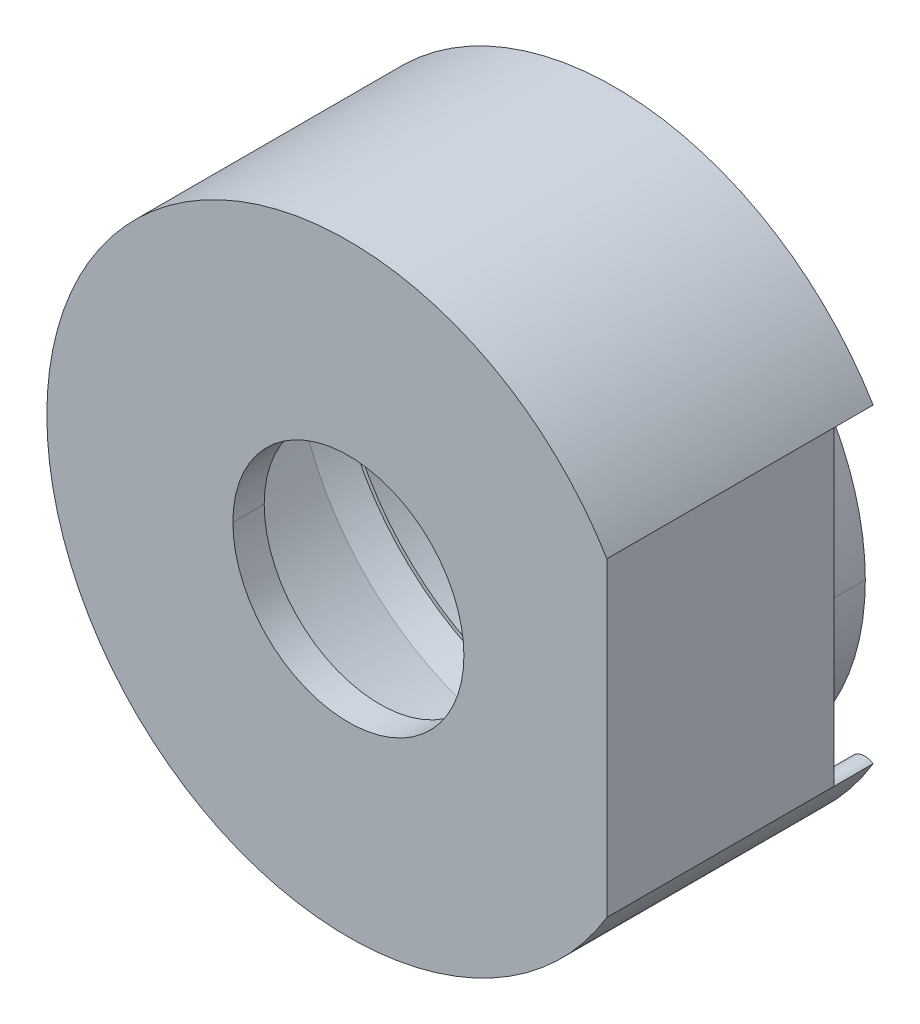
ISO-10303-21;
HEADER;
FILE_DESCRIPTION(('STEP AP214'),'2;1');
FILE_NAME('part.step','',(''),(''),'','','');
FILE_SCHEMA(('AUTOMOTIVE_DESIGN { 1 0 10303 214 1 1 1 1 }'));
ENDSEC;
DATA;
#1=APPLICATION_CONTEXT('core data for automotive mechanical design processes');
#2=APPLICATION_PROTOCOL_DEFINITION('international standard','automotive_design',2000,#1);
#3=PRODUCT_CONTEXT('',#1,'mechanical');
#4=PRODUCT('Part','Part','',(#3));
#5=PRODUCT_RELATED_PRODUCT_CATEGORY('part','',(#4));
#6=PRODUCT_DEFINITION_FORMATION('','',#4);
#7=PRODUCT_DEFINITION_CONTEXT('part definition',#1,'design');
#8=PRODUCT_DEFINITION('design','',#6,#7);
#9=PRODUCT_DEFINITION_SHAPE('','',#8);
#10=(LENGTH_UNIT() NAMED_UNIT(*) SI_UNIT(.MILLI.,.METRE.));
#11=(NAMED_UNIT(*) PLANE_ANGLE_UNIT() SI_UNIT($,.RADIAN.));
#12=(NAMED_UNIT(*) SI_UNIT($,.STERADIAN.) SOLID_ANGLE_UNIT());
#13=UNCERTAINTY_MEASURE_WITH_UNIT(LENGTH_MEASURE(1.E-05),#10,'distance_accuracy_value','');
#14=(GEOMETRIC_REPRESENTATION_CONTEXT(3) GLOBAL_UNCERTAINTY_ASSIGNED_CONTEXT((#13)) GLOBAL_UNIT_ASSIGNED_CONTEXT((#10,
#11,#12)) REPRESENTATION_CONTEXT('',''));
#15=CARTESIAN_POINT('',(0.,0.,0.));
#16=DIRECTION('',(0.,0.,1.));
#17=DIRECTION('',(1.,0.,0.));
#18=AXIS2_PLACEMENT_3D('',#15,#16,#17);
#19=CARTESIAN_POINT('',(15.9628315737893,10.7587410112352,2.5));
#20=DIRECTION('',(0.,0.,-1.));
#21=DIRECTION('',(-1.,0.,0.));
#22=AXIS2_PLACEMENT_3D('',#19,#20,#21);
#23=CYLINDRICAL_SURFACE('',#22,1.);
#24=CARTESIAN_POINT('',(15.9628315737893,10.7587410112352,2.5));
#25=DIRECTION('',(0.,0.,1.));
#26=DIRECTION('',(1.,0.,0.));
#27=AXIS2_PLACEMENT_3D('',#24,#25,#26);
#28=CIRCLE('',#27,1.);
#29=CARTESIAN_POINT('',(15.1335935699561,10.1998453742879,2.5));
#30=VERTEX_POINT('',#29);
#31=CARTESIAN_POINT('',(16.5,9.91526600752596,2.5));
#32=VERTEX_POINT('',#31);
#33=EDGE_CURVE('E215',#30,#32,#28,.T.);
#34=ORIENTED_EDGE('',*,*,#33,.F.);
#35=DIRECTION('',(0.,0.,1.));
#36=VECTOR('',#35,1.);
#37=CARTESIAN_POINT('',(15.1335935699561,10.1998453742879,2.5));
#38=LINE('',#37,#36);
#39=CARTESIAN_POINT('',(15.1335935699561,10.1998453742879,0.));
#40=VERTEX_POINT('',#39);
#41=EDGE_CURVE('E167',#40,#30,#38,.T.);
#42=ORIENTED_EDGE('',*,*,#41,.F.);
#43=CARTESIAN_POINT('',(15.9628315737893,10.7587410112352,0.));
#44=DIRECTION('',(0.,0.,-1.));
#45=DIRECTION('',(1.,0.,0.));
#46=AXIS2_PLACEMENT_3D('',#43,#44,#45);
#47=CIRCLE('',#46,1.);
#48=CARTESIAN_POINT('',(16.5,9.91526600752596,0.));
#49=VERTEX_POINT('',#48);
#50=EDGE_CURVE('E183',#49,#40,#47,.T.);
#51=ORIENTED_EDGE('',*,*,#50,.F.);
#52=DIRECTION('',(0.,0.,-1.));
#53=VECTOR('',#52,1.);
#54=CARTESIAN_POINT('',(16.5,9.91526600752596,2.5));
#55=LINE('',#54,#53);
#56=EDGE_CURVE('E169',#32,#49,#55,.T.);
#57=ORIENTED_EDGE('',*,*,#56,.F.);
#58=EDGE_LOOP('',(#34,#42,#51,#57));
#59=FACE_BOUND('',#58,.T.);
#60=ADVANCED_FACE('F14',(#59),#23,.T.);
#61=CARTESIAN_POINT('',(15.9628315737893,-10.7587410112352,2.5));
#62=DIRECTION('',(0.,0.,1.));
#63=DIRECTION('',(1.,0.,0.));
#64=AXIS2_PLACEMENT_3D('',#61,#62,#63);
#65=CYLINDRICAL_SURFACE('',#64,1.);
#66=CARTESIAN_POINT('',(15.9628315737893,-10.7587410112352,0.));
#67=DIRECTION('',(0.,0.,-1.));
#68=DIRECTION('',(1.,0.,0.));
#69=AXIS2_PLACEMENT_3D('',#66,#67,#68);
#70=CIRCLE('',#69,1.);
#71=CARTESIAN_POINT('',(15.1335935699561,-10.1998453742879,0.));
#72=VERTEX_POINT('',#71);
#73=CARTESIAN_POINT('',(16.5,-9.91526600752597,0.));
#74=VERTEX_POINT('',#73);
#75=EDGE_CURVE('E222',#72,#74,#70,.T.);
#76=ORIENTED_EDGE('',*,*,#75,.F.);
#77=DIRECTION('',(0.,0.,-1.));
#78=VECTOR('',#77,1.);
#79=CARTESIAN_POINT('',(15.1335935699561,-10.1998453742879,2.5));
#80=LINE('',#79,#78);
#81=CARTESIAN_POINT('',(15.1335935699561,-10.1998453742879,2.5));
#82=VERTEX_POINT('',#81);
#83=EDGE_CURVE('E211',#82,#72,#80,.T.);
#84=ORIENTED_EDGE('',*,*,#83,.F.);
#85=CARTESIAN_POINT('',(15.9628315737893,-10.7587410112352,2.5));
#86=DIRECTION('',(0.,0.,1.));
#87=DIRECTION('',(1.,0.,0.));
#88=AXIS2_PLACEMENT_3D('',#85,#86,#87);
#89=CIRCLE('',#88,1.);
#90=CARTESIAN_POINT('',(16.5,-9.91526600752597,2.5));
#91=VERTEX_POINT('',#90);
#92=EDGE_CURVE('E40',#91,#82,#89,.T.);
#93=ORIENTED_EDGE('',*,*,#92,.F.);
#94=DIRECTION('',(0.,0.,1.));
#95=VECTOR('',#94,1.);
#96=CARTESIAN_POINT('',(16.5,-9.91526600752597,2.5));
#97=LINE('',#96,#95);
#98=EDGE_CURVE('E173',#74,#91,#97,.T.);
#99=ORIENTED_EDGE('',*,*,#98,.F.);
#100=EDGE_LOOP('',(#76,#84,#93,#99));
#101=FACE_BOUND('',#100,.T.);
#102=ADVANCED_FACE('F304',(#101),#65,.T.);
#103=CARTESIAN_POINT('',(16.5,16.5737441106063,17.));
#104=DIRECTION('',(-1.,0.,0.));
#105=DIRECTION('',(0.,0.,1.));
#106=AXIS2_PLACEMENT_3D('',#103,#104,#105);
#107=PLANE('',#106);
#108=DIRECTION('',(0.,0.,1.));
#109=VECTOR('',#108,1.);
#110=CARTESIAN_POINT('',(16.5,-9.91526600752597,2.5));
#111=LINE('',#110,#109);
#112=CARTESIAN_POINT('',(16.5,-9.91526600752597,17.));
#113=VERTEX_POINT('',#112);
#114=EDGE_CURVE('E177',#91,#113,#111,.T.);
#115=ORIENTED_EDGE('',*,*,#114,.F.);
#116=DIRECTION('',(0.,-1.,0.));
#117=VECTOR('',#116,1.);
#118=CARTESIAN_POINT('',(16.5,0.,2.5));
#119=LINE('',#118,#117);
#120=EDGE_CURVE('E212',#32,#91,#119,.T.);
#121=ORIENTED_EDGE('',*,*,#120,.F.);
#122=DIRECTION('',(0.,0.,-1.));
#123=VECTOR('',#122,1.);
#124=CARTESIAN_POINT('',(16.5,9.91526600752596,2.5));
#125=LINE('',#124,#123);
#126=CARTESIAN_POINT('',(16.5,9.91526600752596,17.));
#127=VERTEX_POINT('',#126);
#128=EDGE_CURVE('E172',#127,#32,#125,.T.);
#129=ORIENTED_EDGE('',*,*,#128,.F.);
#130=DIRECTION('',(0.,1.,0.));
#131=VECTOR('',#130,1.);
#132=CARTESIAN_POINT('',(16.5,16.5737441106063,17.));
#133=LINE('',#132,#131);
#134=EDGE_CURVE('E251',#113,#127,#133,.T.);
#135=ORIENTED_EDGE('',*,*,#134,.F.);
#136=EDGE_LOOP('',(#115,#121,#129,#135));
#137=FACE_BOUND('',#136,.T.);
#138=ADVANCED_FACE('F310',(#137),#107,.F.);
#139=CARTESIAN_POINT('',(0.,0.,6.5));
#140=DIRECTION('',(0.,0.,1.));
#141=DIRECTION('',(1.,0.,0.));
#142=AXIS2_PLACEMENT_3D('',#139,#140,#141);
#143=CONICAL_SURFACE('',#142,16.4973120113727,0.244346095279213);
#144=DIRECTION('',(-0.241921895599675,0.,0.970295726275995));
#145=VECTOR('',#144,1.);
#146=CARTESIAN_POINT('',(-16.4973120113727,0.,6.5));
#147=LINE('',#146,#145);
#148=CARTESIAN_POINT('',(-15.5,0.,2.5));
#149=VERTEX_POINT('',#148);
#150=CARTESIAN_POINT('',(-16.,0.,4.50539046676785));
#151=VERTEX_POINT('',#150);
#152=EDGE_CURVE('E240',#149,#151,#147,.T.);
#153=ORIENTED_EDGE('',*,*,#152,.F.);
#154=CARTESIAN_POINT('',(0.,0.,2.5));
#155=DIRECTION('',(0.,0.,-1.));
#156=DIRECTION('',(1.,0.,0.));
#157=AXIS2_PLACEMENT_3D('',#154,#155,#156);
#158=CIRCLE('',#157,15.5);
#159=CARTESIAN_POINT('',(15.5,0.,2.5));
#160=VERTEX_POINT('',#159);
#161=EDGE_CURVE('E218',#149,#160,#158,.T.);
#162=ORIENTED_EDGE('',*,*,#161,.T.);
#163=DIRECTION('',(0.241921895599675,0.,0.970295726275995));
#164=VECTOR('',#163,1.);
#165=CARTESIAN_POINT('',(16.4973120113727,0.,6.5));
#166=LINE('',#165,#164);
#167=CARTESIAN_POINT('',(16.,0.,4.50539046676785));
#168=VERTEX_POINT('',#167);
#169=EDGE_CURVE('E184',#160,#168,#166,.T.);
#170=ORIENTED_EDGE('',*,*,#169,.T.);
#171=CARTESIAN_POINT('',(0.,0.,4.50539046676785));
#172=DIRECTION('',(0.,0.,-1.));
#173=DIRECTION('',(1.,0.,0.));
#174=AXIS2_PLACEMENT_3D('',#171,#172,#173);
#175=CIRCLE('',#174,16.);
#176=EDGE_CURVE('E257',#151,#168,#175,.T.);
#177=ORIENTED_EDGE('',*,*,#176,.F.);
#178=EDGE_LOOP('',(#153,#162,#170,#177));
#179=FACE_BOUND('',#178,.T.);
#180=ADVANCED_FACE('F275',(#179),#143,.F.);
#181=CARTESIAN_POINT('',(0.,0.,0.));
#182=DIRECTION('',(0.,0.,-1.));
#183=DIRECTION('',(0.,-1.,0.));
#184=AXIS2_PLACEMENT_3D('',#181,#182,#183);
#185=PLANE('',#184);
#186=CARTESIAN_POINT('',(0.,0.,0.));
#187=DIRECTION('',(0.,0.,-1.));
#188=DIRECTION('',(-1.,0.,0.));
#189=AXIS2_PLACEMENT_3D('',#186,#187,#188);
#190=CIRCLE('',#189,15.25);
#191=CARTESIAN_POINT('',(-15.25,0.,0.));
#192=VERTEX_POINT('',#191);
#193=CARTESIAN_POINT('',(15.25,0.,0.));
#194=VERTEX_POINT('',#193);
#195=EDGE_CURVE('E9',#192,#194,#190,.T.);
#196=ORIENTED_EDGE('',*,*,#195,.F.);
#197=CARTESIAN_POINT('',(0.,0.,0.));
#198=DIRECTION('',(0.,0.,-1.));
#199=DIRECTION('',(-1.,0.,0.));
#200=AXIS2_PLACEMENT_3D('',#197,#198,#199);
#201=CIRCLE('',#200,15.25);
#202=EDGE_CURVE('E189',#194,#192,#201,.T.);
#203=ORIENTED_EDGE('',*,*,#202,.F.);
#204=EDGE_LOOP('',(#196,#203));
#205=FACE_BOUND('',#204,.T.);
#206=CARTESIAN_POINT('',(0.,0.,0.));
#207=DIRECTION('',(0.,0.,-1.));
#208=DIRECTION('',(-1.,0.,0.));
#209=AXIS2_PLACEMENT_3D('',#206,#207,#208);
#210=CIRCLE('',#209,16.);
#211=CARTESIAN_POINT('',(-16.,0.,0.));
#212=VERTEX_POINT('',#211);
#213=CARTESIAN_POINT('',(16.,0.,0.));
#214=VERTEX_POINT('',#213);
#215=EDGE_CURVE('E148',#212,#214,#210,.T.);
#216=ORIENTED_EDGE('',*,*,#215,.T.);
#217=CARTESIAN_POINT('',(0.,0.,0.));
#218=DIRECTION('',(0.,0.,-1.));
#219=DIRECTION('',(-1.,0.,0.));
#220=AXIS2_PLACEMENT_3D('',#217,#218,#219);
#221=CIRCLE('',#220,16.);
#222=EDGE_CURVE('E25',#214,#212,#221,.T.);
#223=ORIENTED_EDGE('',*,*,#222,.T.);
#224=EDGE_LOOP('',(#216,#223));
#225=FACE_BOUND('',#224,.T.);
#226=ADVANCED_FACE('F149',(#205,#225),#185,.T.);
#227=CARTESIAN_POINT('',(0.,0.,47.754833995939));
#228=DIRECTION('',(0.,0.,-1.));
#229=DIRECTION('',(-1.,0.,0.));
#230=AXIS2_PLACEMENT_3D('',#227,#228,#229);
#231=CYLINDRICAL_SURFACE('',#230,15.25);
#232=DIRECTION('',(0.,0.,-1.));
#233=VECTOR('',#232,1.);
#234=CARTESIAN_POINT('',(15.25,0.,47.754833995939));
#235=LINE('',#234,#233);
#236=CARTESIAN_POINT('',(15.25,0.,2.5));
#237=VERTEX_POINT('',#236);
#238=EDGE_CURVE('E193',#237,#194,#235,.T.);
#239=ORIENTED_EDGE('',*,*,#238,.F.);
#240=CARTESIAN_POINT('',(0.,0.,2.5));
#241=DIRECTION('',(0.,0.,-1.));
#242=DIRECTION('',(1.,0.,0.));
#243=AXIS2_PLACEMENT_3D('',#240,#241,#242);
#244=CIRCLE('',#243,15.25);
#245=CARTESIAN_POINT('',(-15.25,0.,2.5));
#246=VERTEX_POINT('',#245);
#247=EDGE_CURVE('E146',#246,#237,#244,.T.);
#248=ORIENTED_EDGE('',*,*,#247,.F.);
#249=DIRECTION('',(0.,0.,-1.));
#250=VECTOR('',#249,1.);
#251=CARTESIAN_POINT('',(-15.25,0.,47.754833995939));
#252=LINE('',#251,#250);
#253=EDGE_CURVE('E163',#246,#192,#252,.T.);
#254=ORIENTED_EDGE('',*,*,#253,.T.);
#255=ORIENTED_EDGE('',*,*,#195,.T.);
#256=EDGE_LOOP('',(#239,#248,#254,#255));
#257=FACE_BOUND('',#256,.T.);
#258=ADVANCED_FACE('F299',(#257),#231,.F.);
#259=CARTESIAN_POINT('',(0.,0.,47.754833995939));
#260=DIRECTION('',(0.,0.,-1.));
#261=DIRECTION('',(-1.,0.,0.));
#262=AXIS2_PLACEMENT_3D('',#259,#260,#261);
#263=CYLINDRICAL_SURFACE('',#262,16.);
#264=DIRECTION('',(0.,0.,-1.));
#265=VECTOR('',#264,1.);
#266=CARTESIAN_POINT('',(16.,0.,47.754833995939));
#267=LINE('',#266,#265);
#268=CARTESIAN_POINT('',(16.,0.,2.5));
#269=VERTEX_POINT('',#268);
#270=EDGE_CURVE('E139',#269,#214,#267,.T.);
#271=ORIENTED_EDGE('',*,*,#270,.F.);
#272=CARTESIAN_POINT('',(0.,0.,2.5));
#273=DIRECTION('',(0.,0.,-1.));
#274=DIRECTION('',(1.,0.,0.));
#275=AXIS2_PLACEMENT_3D('',#272,#273,#274);
#276=CIRCLE('',#275,16.);
#277=CARTESIAN_POINT('',(-16.,0.,2.5));
#278=VERTEX_POINT('',#277);
#279=EDGE_CURVE('E232',#269,#278,#276,.T.);
#280=ORIENTED_EDGE('',*,*,#279,.T.);
#281=DIRECTION('',(0.,0.,-1.));
#282=VECTOR('',#281,1.);
#283=CARTESIAN_POINT('',(-16.,0.,47.754833995939));
#284=LINE('',#283,#282);
#285=EDGE_CURVE('E142',#278,#212,#284,.T.);
#286=ORIENTED_EDGE('',*,*,#285,.T.);
#287=ORIENTED_EDGE('',*,*,#222,.F.);
#288=EDGE_LOOP('',(#271,#280,#286,#287));
#289=FACE_BOUND('',#288,.T.);
#290=ADVANCED_FACE('F137',(#289),#263,.T.);
#291=CARTESIAN_POINT('',(0.,0.,2.5));
#292=DIRECTION('',(0.,0.,1.));
#293=DIRECTION('',(1.,0.,0.));
#294=AXIS2_PLACEMENT_3D('',#291,#292,#293);
#295=PLANE('',#294);
#296=ORIENTED_EDGE('',*,*,#247,.T.);
#297=CARTESIAN_POINT('',(0.,0.,2.5));
#298=DIRECTION('',(0.,0.,-1.));
#299=DIRECTION('',(1.,0.,0.));
#300=AXIS2_PLACEMENT_3D('',#297,#298,#299);
#301=CIRCLE('',#300,15.25);
#302=EDGE_CURVE('E188',#237,#246,#301,.T.);
#303=ORIENTED_EDGE('',*,*,#302,.T.);
#304=EDGE_LOOP('',(#296,#303));
#305=FACE_BOUND('',#304,.T.);
#306=CARTESIAN_POINT('',(0.,0.,2.5));
#307=DIRECTION('',(0.,0.,-1.));
#308=DIRECTION('',(1.,0.,0.));
#309=AXIS2_PLACEMENT_3D('',#306,#307,#308);
#310=CIRCLE('',#309,15.5);
#311=EDGE_CURVE('E244',#160,#149,#310,.T.);
#312=ORIENTED_EDGE('',*,*,#311,.F.);
#313=ORIENTED_EDGE('',*,*,#161,.F.);
#314=EDGE_LOOP('',(#312,#313));
#315=FACE_BOUND('',#314,.T.);
#316=ADVANCED_FACE('F286',(#305,#315),#295,.T.);
#317=CARTESIAN_POINT('',(0.,0.,15.));
#318=DIRECTION('',(0.,0.,1.));
#319=DIRECTION('',(1.,0.,0.));
#320=AXIS2_PLACEMENT_3D('',#317,#318,#319);
#321=CYLINDRICAL_SURFACE('',#320,7.375);
#322=DIRECTION('',(0.,0.,1.));
#323=VECTOR('',#322,1.);
#324=CARTESIAN_POINT('',(-7.375,0.,15.));
#325=LINE('',#324,#323);
#326=CARTESIAN_POINT('',(-7.375,0.,15.));
#327=VERTEX_POINT('',#326);
#328=CARTESIAN_POINT('',(-7.375,0.,17.));
#329=VERTEX_POINT('',#328);
#330=EDGE_CURVE('E199',#327,#329,#325,.T.);
#331=ORIENTED_EDGE('',*,*,#330,.F.);
#332=CARTESIAN_POINT('',(0.,0.,15.));
#333=DIRECTION('',(0.,0.,1.));
#334=DIRECTION('',(1.,0.,0.));
#335=AXIS2_PLACEMENT_3D('',#332,#333,#334);
#336=CIRCLE('',#335,7.375);
#337=CARTESIAN_POINT('',(7.375,0.,15.));
#338=VERTEX_POINT('',#337);
#339=EDGE_CURVE('E234',#338,#327,#336,.T.);
#340=ORIENTED_EDGE('',*,*,#339,.F.);
#341=DIRECTION('',(0.,0.,1.));
#342=VECTOR('',#341,1.);
#343=CARTESIAN_POINT('',(7.375,0.,15.));
#344=LINE('',#343,#342);
#345=CARTESIAN_POINT('',(7.375,0.,17.));
#346=VERTEX_POINT('',#345);
#347=EDGE_CURVE('E198',#338,#346,#344,.T.);
#348=ORIENTED_EDGE('',*,*,#347,.T.);
#349=CARTESIAN_POINT('',(0.,0.,17.));
#350=DIRECTION('',(0.,0.,1.));
#351=DIRECTION('',(1.,0.,0.));
#352=AXIS2_PLACEMENT_3D('',#349,#350,#351);
#353=CIRCLE('',#352,7.375);
#354=EDGE_CURVE('E247',#346,#329,#353,.T.);
#355=ORIENTED_EDGE('',*,*,#354,.T.);
#356=EDGE_LOOP('',(#331,#340,#348,#355));
#357=FACE_BOUND('',#356,.T.);
#358=ADVANCED_FACE('F288',(#357),#321,.F.);
#359=CARTESIAN_POINT('',(0.,0.,15.));
#360=DIRECTION('',(0.,0.,1.));
#361=DIRECTION('',(1.,0.,0.));
#362=AXIS2_PLACEMENT_3D('',#359,#360,#361);
#363=PLANE('',#362);
#364=ORIENTED_EDGE('',*,*,#339,.T.);
#365=CARTESIAN_POINT('',(0.,0.,15.));
#366=DIRECTION('',(0.,0.,1.));
#367=DIRECTION('',(1.,0.,0.));
#368=AXIS2_PLACEMENT_3D('',#365,#366,#367);
#369=CIRCLE('',#368,7.375);
#370=EDGE_CURVE('E202',#327,#338,#369,.T.);
#371=ORIENTED_EDGE('',*,*,#370,.T.);
#372=EDGE_LOOP('',(#364,#371));
#373=FACE_BOUND('',#372,.T.);
#374=CARTESIAN_POINT('',(0.,0.,15.));
#375=DIRECTION('',(0.,0.,1.));
#376=DIRECTION('',(1.,0.,0.));
#377=AXIS2_PLACEMENT_3D('',#374,#375,#376);
#378=CIRCLE('',#377,16.);
#379=CARTESIAN_POINT('',(-16.,0.,15.));
#380=VERTEX_POINT('',#379);
#381=CARTESIAN_POINT('',(16.,0.,15.));
#382=VERTEX_POINT('',#381);
#383=EDGE_CURVE('E228',#380,#382,#378,.T.);
#384=ORIENTED_EDGE('',*,*,#383,.F.);
#385=CARTESIAN_POINT('',(0.,0.,15.));
#386=DIRECTION('',(0.,0.,1.));
#387=DIRECTION('',(1.,0.,0.));
#388=AXIS2_PLACEMENT_3D('',#385,#386,#387);
#389=CIRCLE('',#388,16.);
#390=EDGE_CURVE('E239',#382,#380,#389,.T.);
#391=ORIENTED_EDGE('',*,*,#390,.F.);
#392=EDGE_LOOP('',(#384,#391));
#393=FACE_BOUND('',#392,.T.);
#394=ADVANCED_FACE('F296',(#373,#393),#363,.F.);
#395=CARTESIAN_POINT('',(0.,0.,2.5));
#396=DIRECTION('',(0.,0.,1.));
#397=DIRECTION('',(1.,0.,0.));
#398=AXIS2_PLACEMENT_3D('',#395,#396,#397);
#399=PLANE('',#398);
#400=CARTESIAN_POINT('',(0.,0.,2.5));
#401=DIRECTION('',(0.,0.,-1.));
#402=DIRECTION('',(1.,0.,0.));
#403=AXIS2_PLACEMENT_3D('',#400,#401,#402);
#404=CIRCLE('',#403,16.);
#405=EDGE_CURVE('E155',#278,#269,#404,.T.);
#406=ORIENTED_EDGE('',*,*,#405,.F.);
#407=ORIENTED_EDGE('',*,*,#279,.F.);
#408=EDGE_LOOP('',(#406,#407));
#409=FACE_BOUND('',#408,.T.);
#410=CARTESIAN_POINT('',(0.,0.,2.5));
#411=DIRECTION('',(0.,0.,1.));
#412=DIRECTION('',(1.,0.,0.));
#413=AXIS2_PLACEMENT_3D('',#410,#411,#412);
#414=CIRCLE('',#413,18.25);
#415=CARTESIAN_POINT('',(-18.25,0.,2.5));
#416=VERTEX_POINT('',#415);
#417=EDGE_CURVE('E379',#30,#416,#414,.T.);
#418=ORIENTED_EDGE('',*,*,#417,.F.);
#419=ORIENTED_EDGE('',*,*,#33,.T.);
#420=ORIENTED_EDGE('',*,*,#120,.T.);
#421=ORIENTED_EDGE('',*,*,#92,.T.);
#422=CARTESIAN_POINT('',(0.,0.,2.5));
#423=DIRECTION('',(0.,0.,1.));
#424=DIRECTION('',(1.,0.,0.));
#425=AXIS2_PLACEMENT_3D('',#422,#423,#424);
#426=CIRCLE('',#425,18.25);
#427=EDGE_CURVE('E171',#416,#82,#426,.T.);
#428=ORIENTED_EDGE('',*,*,#427,.F.);
#429=EDGE_LOOP('',(#418,#419,#420,#421,#428));
#430=FACE_BOUND('',#429,.T.);
#431=ADVANCED_FACE('F16',(#409,#430),#399,.F.);
#432=CARTESIAN_POINT('',(0.,0.,17.));
#433=DIRECTION('',(0.,0.,1.));
#434=DIRECTION('',(1.,0.,0.));
#435=AXIS2_PLACEMENT_3D('',#432,#433,#434);
#436=PLANE('',#435);
#437=ORIENTED_EDGE('',*,*,#354,.F.);
#438=CARTESIAN_POINT('',(0.,0.,17.));
#439=DIRECTION('',(0.,0.,1.));
#440=DIRECTION('',(1.,0.,0.));
#441=AXIS2_PLACEMENT_3D('',#438,#439,#440);
#442=CIRCLE('',#441,7.375);
#443=EDGE_CURVE('E194',#329,#346,#442,.T.);
#444=ORIENTED_EDGE('',*,*,#443,.F.);
#445=EDGE_LOOP('',(#437,#444));
#446=FACE_BOUND('',#445,.T.);
#447=ORIENTED_EDGE('',*,*,#134,.T.);
#448=CARTESIAN_POINT('',(0.,0.,17.));
#449=DIRECTION('',(0.,0.,1.));
#450=DIRECTION('',(1.,0.,0.));
#451=AXIS2_PLACEMENT_3D('',#448,#449,#450);
#452=CIRCLE('',#451,19.25);
#453=CARTESIAN_POINT('',(-19.25,0.,17.));
#454=VERTEX_POINT('',#453);
#455=EDGE_CURVE('E179',#127,#454,#452,.T.);
#456=ORIENTED_EDGE('',*,*,#455,.T.);
#457=CARTESIAN_POINT('',(0.,0.,17.));
#458=DIRECTION('',(0.,0.,1.));
#459=DIRECTION('',(1.,0.,0.));
#460=AXIS2_PLACEMENT_3D('',#457,#458,#459);
#461=CIRCLE('',#460,19.25);
#462=EDGE_CURVE('E372',#454,#113,#461,.T.);
#463=ORIENTED_EDGE('',*,*,#462,.T.);
#464=EDGE_LOOP('',(#447,#456,#463));
#465=FACE_BOUND('',#464,.T.);
#466=ADVANCED_FACE('F346',(#446,#465),#436,.T.);
#467=CARTESIAN_POINT('',(0.,0.,2.5));
#468=DIRECTION('',(0.,0.,-1.));
#469=DIRECTION('',(-1.,0.,0.));
#470=AXIS2_PLACEMENT_3D('',#467,#468,#469);
#471=CYLINDRICAL_SURFACE('',#470,18.25);
#472=DIRECTION('',(0.,0.,-1.));
#473=VECTOR('',#472,1.);
#474=CARTESIAN_POINT('',(-18.25,0.,2.5));
#475=LINE('',#474,#473);
#476=CARTESIAN_POINT('',(-18.25,0.,0.));
#477=VERTEX_POINT('',#476);
#478=EDGE_CURVE('E207',#416,#477,#475,.T.);
#479=ORIENTED_EDGE('',*,*,#478,.F.);
#480=ORIENTED_EDGE('',*,*,#427,.T.);
#481=ORIENTED_EDGE('',*,*,#83,.T.);
#482=CARTESIAN_POINT('',(0.,0.,0.));
#483=DIRECTION('',(0.,0.,1.));
#484=DIRECTION('',(1.,0.,0.));
#485=AXIS2_PLACEMENT_3D('',#482,#483,#484);
#486=CIRCLE('',#485,18.25);
#487=EDGE_CURVE('E230',#477,#72,#486,.T.);
#488=ORIENTED_EDGE('',*,*,#487,.F.);
#489=EDGE_LOOP('',(#479,#480,#481,#488));
#490=FACE_BOUND('',#489,.T.);
#491=ADVANCED_FACE('F334',(#490),#471,.F.);
#492=CARTESIAN_POINT('',(0.,0.,2.5));
#493=DIRECTION('',(0.,0.,-1.));
#494=DIRECTION('',(-1.,0.,0.));
#495=AXIS2_PLACEMENT_3D('',#492,#493,#494);
#496=CYLINDRICAL_SURFACE('',#495,19.25);
#497=DIRECTION('',(0.,0.,-1.));
#498=VECTOR('',#497,1.);
#499=CARTESIAN_POINT('',(-19.25,0.,2.5));
#500=LINE('',#499,#498);
#501=CARTESIAN_POINT('',(-19.25,0.,0.));
#502=VERTEX_POINT('',#501);
#503=EDGE_CURVE('E389',#454,#502,#500,.T.);
#504=ORIENTED_EDGE('',*,*,#503,.F.);
#505=ORIENTED_EDGE('',*,*,#455,.F.);
#506=ORIENTED_EDGE('',*,*,#128,.T.);
#507=ORIENTED_EDGE('',*,*,#56,.T.);
#508=CARTESIAN_POINT('',(0.,0.,0.));
#509=DIRECTION('',(0.,0.,1.));
#510=DIRECTION('',(1.,0.,0.));
#511=AXIS2_PLACEMENT_3D('',#508,#509,#510);
#512=CIRCLE('',#511,19.25);
#513=EDGE_CURVE('E219',#49,#502,#512,.T.);
#514=ORIENTED_EDGE('',*,*,#513,.T.);
#515=EDGE_LOOP('',(#504,#505,#506,#507,#514));
#516=FACE_BOUND('',#515,.T.);
#517=ADVANCED_FACE('F330',(#516),#496,.T.);
#518=CARTESIAN_POINT('',(0.,0.,0.));
#519=DIRECTION('',(0.,0.,1.));
#520=DIRECTION('',(1.,0.,0.));
#521=AXIS2_PLACEMENT_3D('',#518,#519,#520);
#522=PLANE('',#521);
#523=CARTESIAN_POINT('',(0.,0.,0.));
#524=DIRECTION('',(0.,0.,1.));
#525=DIRECTION('',(1.,0.,0.));
#526=AXIS2_PLACEMENT_3D('',#523,#524,#525);
#527=CIRCLE('',#526,18.25);
#528=EDGE_CURVE('E203',#40,#477,#527,.T.);
#529=ORIENTED_EDGE('',*,*,#528,.T.);
#530=ORIENTED_EDGE('',*,*,#487,.T.);
#531=ORIENTED_EDGE('',*,*,#75,.T.);
#532=CARTESIAN_POINT('',(0.,0.,0.));
#533=DIRECTION('',(0.,0.,1.));
#534=DIRECTION('',(1.,0.,0.));
#535=AXIS2_PLACEMENT_3D('',#532,#533,#534);
#536=CIRCLE('',#535,19.25);
#537=EDGE_CURVE('E178',#502,#74,#536,.T.);
#538=ORIENTED_EDGE('',*,*,#537,.F.);
#539=ORIENTED_EDGE('',*,*,#513,.F.);
#540=ORIENTED_EDGE('',*,*,#50,.T.);
#541=EDGE_LOOP('',(#529,#530,#531,#538,#539,#540));
#542=FACE_BOUND('',#541,.T.);
#543=ADVANCED_FACE('F333',(#542),#522,.F.);
#544=CARTESIAN_POINT('',(0.,0.,17.));
#545=DIRECTION('',(0.,0.,-1.));
#546=DIRECTION('',(-1.,0.,0.));
#547=AXIS2_PLACEMENT_3D('',#544,#545,#546);
#548=CYLINDRICAL_SURFACE('',#547,16.);
#549=DIRECTION('',(0.,0.,-1.));
#550=VECTOR('',#549,1.);
#551=CARTESIAN_POINT('',(16.,0.,17.));
#552=LINE('',#551,#550);
#553=EDGE_CURVE('E223',#382,#168,#552,.T.);
#554=ORIENTED_EDGE('',*,*,#553,.F.);
#555=ORIENTED_EDGE('',*,*,#390,.T.);
#556=DIRECTION('',(0.,0.,-1.));
#557=VECTOR('',#556,1.);
#558=CARTESIAN_POINT('',(-16.,0.,17.));
#559=LINE('',#558,#557);
#560=EDGE_CURVE('E227',#380,#151,#559,.T.);
#561=ORIENTED_EDGE('',*,*,#560,.T.);
#562=ORIENTED_EDGE('',*,*,#176,.T.);
#563=EDGE_LOOP('',(#554,#555,#561,#562));
#564=FACE_BOUND('',#563,.T.);
#565=ADVANCED_FACE('F328',(#564),#548,.F.);
#566=CARTESIAN_POINT('',(0.,0.,17.));
#567=DIRECTION('',(0.,0.,-1.));
#568=DIRECTION('',(-1.,0.,0.));
#569=AXIS2_PLACEMENT_3D('',#566,#567,#568);
#570=CYLINDRICAL_SURFACE('',#569,16.);
#571=ORIENTED_EDGE('',*,*,#383,.T.);
#572=ORIENTED_EDGE('',*,*,#553,.T.);
#573=CARTESIAN_POINT('',(0.,0.,4.50539046676785));
#574=DIRECTION('',(0.,0.,-1.));
#575=DIRECTION('',(1.,0.,0.));
#576=AXIS2_PLACEMENT_3D('',#573,#574,#575);
#577=CIRCLE('',#576,16.);
#578=EDGE_CURVE('E18',#168,#151,#577,.T.);
#579=ORIENTED_EDGE('',*,*,#578,.T.);
#580=ORIENTED_EDGE('',*,*,#560,.F.);
#581=EDGE_LOOP('',(#571,#572,#579,#580));
#582=FACE_BOUND('',#581,.T.);
#583=ADVANCED_FACE('F325',(#582),#570,.F.);
#584=CARTESIAN_POINT('',(0.,0.,2.5));
#585=DIRECTION('',(0.,0.,-1.));
#586=DIRECTION('',(-1.,0.,0.));
#587=AXIS2_PLACEMENT_3D('',#584,#585,#586);
#588=CYLINDRICAL_SURFACE('',#587,19.25);
#589=ORIENTED_EDGE('',*,*,#462,.F.);
#590=ORIENTED_EDGE('',*,*,#503,.T.);
#591=ORIENTED_EDGE('',*,*,#537,.T.);
#592=ORIENTED_EDGE('',*,*,#98,.T.);
#593=ORIENTED_EDGE('',*,*,#114,.T.);
#594=EDGE_LOOP('',(#589,#590,#591,#592,#593));
#595=FACE_BOUND('',#594,.T.);
#596=ADVANCED_FACE('F323',(#595),#588,.T.);
#597=CARTESIAN_POINT('',(0.,0.,2.5));
#598=DIRECTION('',(0.,0.,-1.));
#599=DIRECTION('',(-1.,0.,0.));
#600=AXIS2_PLACEMENT_3D('',#597,#598,#599);
#601=CYLINDRICAL_SURFACE('',#600,18.25);
#602=ORIENTED_EDGE('',*,*,#417,.T.);
#603=ORIENTED_EDGE('',*,*,#478,.T.);
#604=ORIENTED_EDGE('',*,*,#528,.F.);
#605=ORIENTED_EDGE('',*,*,#41,.T.);
#606=EDGE_LOOP('',(#602,#603,#604,#605));
#607=FACE_BOUND('',#606,.T.);
#608=ADVANCED_FACE('F319',(#607),#601,.F.);
#609=CARTESIAN_POINT('',(0.,0.,15.));
#610=DIRECTION('',(0.,0.,1.));
#611=DIRECTION('',(1.,0.,0.));
#612=AXIS2_PLACEMENT_3D('',#609,#610,#611);
#613=CYLINDRICAL_SURFACE('',#612,7.375);
#614=ORIENTED_EDGE('',*,*,#370,.F.);
#615=ORIENTED_EDGE('',*,*,#330,.T.);
#616=ORIENTED_EDGE('',*,*,#443,.T.);
#617=ORIENTED_EDGE('',*,*,#347,.F.);
#618=EDGE_LOOP('',(#614,#615,#616,#617));
#619=FACE_BOUND('',#618,.T.);
#620=ADVANCED_FACE('F322',(#619),#613,.F.);
#621=CARTESIAN_POINT('',(0.,0.,47.754833995939));
#622=DIRECTION('',(0.,0.,-1.));
#623=DIRECTION('',(-1.,0.,0.));
#624=AXIS2_PLACEMENT_3D('',#621,#622,#623);
#625=CYLINDRICAL_SURFACE('',#624,16.);
#626=ORIENTED_EDGE('',*,*,#405,.T.);
#627=ORIENTED_EDGE('',*,*,#270,.T.);
#628=ORIENTED_EDGE('',*,*,#215,.F.);
#629=ORIENTED_EDGE('',*,*,#285,.F.);
#630=EDGE_LOOP('',(#626,#627,#628,#629));
#631=FACE_BOUND('',#630,.T.);
#632=ADVANCED_FACE('F153',(#631),#625,.T.);
#633=CARTESIAN_POINT('',(0.,0.,47.754833995939));
#634=DIRECTION('',(0.,0.,-1.));
#635=DIRECTION('',(-1.,0.,0.));
#636=AXIS2_PLACEMENT_3D('',#633,#634,#635);
#637=CYLINDRICAL_SURFACE('',#636,15.25);
#638=ORIENTED_EDGE('',*,*,#302,.F.);
#639=ORIENTED_EDGE('',*,*,#238,.T.);
#640=ORIENTED_EDGE('',*,*,#202,.T.);
#641=ORIENTED_EDGE('',*,*,#253,.F.);
#642=EDGE_LOOP('',(#638,#639,#640,#641));
#643=FACE_BOUND('',#642,.T.);
#644=ADVANCED_FACE('F315',(#643),#637,.F.);
#645=CARTESIAN_POINT('',(0.,0.,6.5));
#646=DIRECTION('',(0.,0.,1.));
#647=DIRECTION('',(1.,0.,0.));
#648=AXIS2_PLACEMENT_3D('',#645,#646,#647);
#649=CONICAL_SURFACE('',#648,16.4973120113727,0.244346095279213);
#650=ORIENTED_EDGE('',*,*,#311,.T.);
#651=ORIENTED_EDGE('',*,*,#152,.T.);
#652=ORIENTED_EDGE('',*,*,#578,.F.);
#653=ORIENTED_EDGE('',*,*,#169,.F.);
#654=EDGE_LOOP('',(#650,#651,#652,#653));
#655=FACE_BOUND('',#654,.T.);
#656=ADVANCED_FACE('F284',(#655),#649,.F.);
#657=CLOSED_SHELL('',(#60,#102,#138,#180,#226,#258,#290,#316,#358,#394,#431,#466,#491,#517,#543,
#565,#583,#596,#608,#620,#632,#644,#656));
#658=MANIFOLD_SOLID_BREP('B1',#657);
#659=ADVANCED_BREP_SHAPE_REPRESENTATION('',(#18,#658),#14);
#660=SHAPE_DEFINITION_REPRESENTATION(#9,#659);
ENDSEC;
END-ISO-10303-21;
